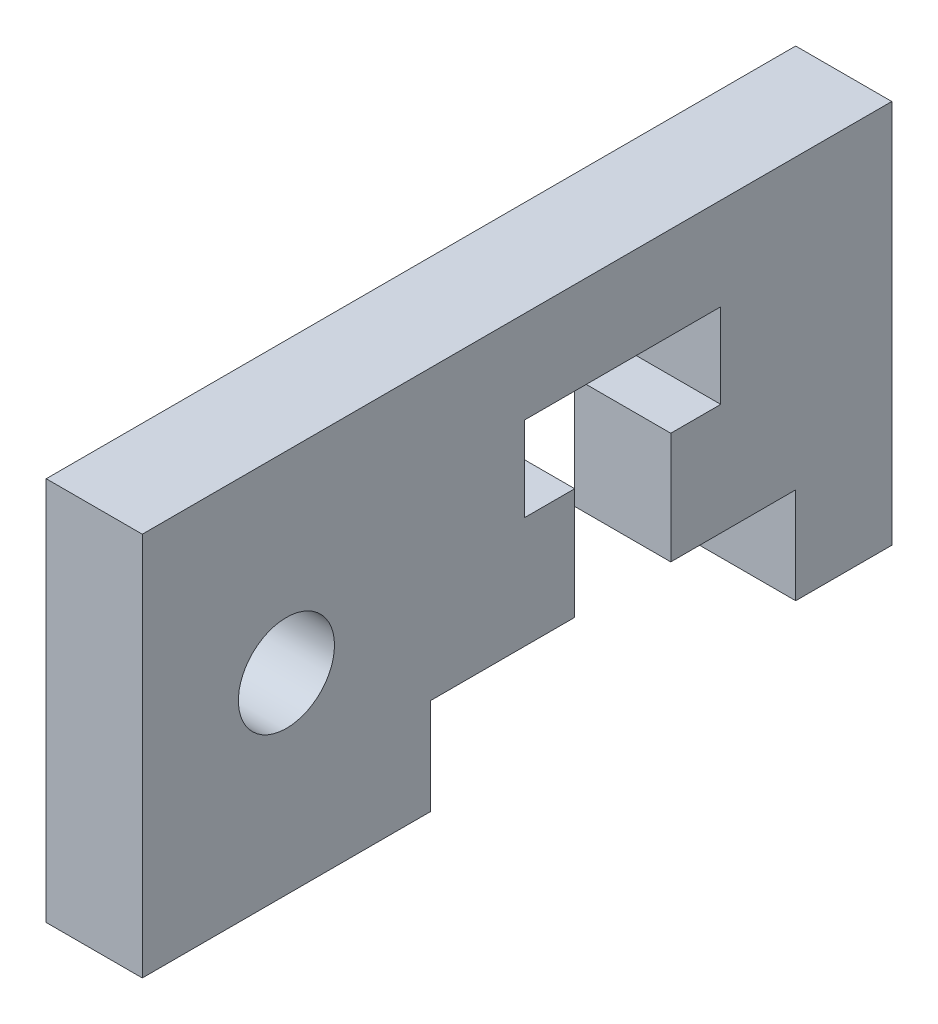
ISO-10303-21;
HEADER;
FILE_DESCRIPTION(('STEP AP214'),'2;1');
FILE_NAME('part.step','',(''),(''),'','','');
FILE_SCHEMA(('AUTOMOTIVE_DESIGN { 1 0 10303 214 1 1 1 1 }'));
ENDSEC;
DATA;
#1=APPLICATION_CONTEXT('core data for automotive mechanical design processes');
#2=APPLICATION_PROTOCOL_DEFINITION('international standard','automotive_design',2000,#1);
#3=PRODUCT_CONTEXT('',#1,'mechanical');
#4=PRODUCT('Part','Part','',(#3));
#5=PRODUCT_RELATED_PRODUCT_CATEGORY('part','',(#4));
#6=PRODUCT_DEFINITION_FORMATION('','',#4);
#7=PRODUCT_DEFINITION_CONTEXT('part definition',#1,'design');
#8=PRODUCT_DEFINITION('design','',#6,#7);
#9=PRODUCT_DEFINITION_SHAPE('','',#8);
#10=(LENGTH_UNIT() NAMED_UNIT(*) SI_UNIT(.MILLI.,.METRE.));
#11=(NAMED_UNIT(*) PLANE_ANGLE_UNIT() SI_UNIT($,.RADIAN.));
#12=(NAMED_UNIT(*) SI_UNIT($,.STERADIAN.) SOLID_ANGLE_UNIT());
#13=UNCERTAINTY_MEASURE_WITH_UNIT(LENGTH_MEASURE(1.E-05),#10,'distance_accuracy_value','');
#14=(GEOMETRIC_REPRESENTATION_CONTEXT(3) GLOBAL_UNCERTAINTY_ASSIGNED_CONTEXT((#13)) GLOBAL_UNIT_ASSIGNED_CONTEXT((#10,
#11,#12)) REPRESENTATION_CONTEXT('',''));
#15=CARTESIAN_POINT('',(0.,0.,0.));
#16=DIRECTION('',(0.,0.,1.));
#17=DIRECTION('',(1.,0.,0.));
#18=AXIS2_PLACEMENT_3D('',#15,#16,#17);
#19=CARTESIAN_POINT('',(-1.5875,6.35,-20.0025));
#20=DIRECTION('',(0.,1.,0.));
#21=DIRECTION('',(0.,0.,1.));
#22=AXIS2_PLACEMENT_3D('',#19,#20,#21);
#23=PLANE('',#22);
#24=DIRECTION('',(1.,0.,0.));
#25=VECTOR('',#24,1.);
#26=CARTESIAN_POINT('',(-1.5875,6.35,4.7625));
#27=LINE('',#26,#25);
#28=CARTESIAN_POINT('',(-1.5875,6.35,4.7625));
#29=VERTEX_POINT('',#28);
#30=CARTESIAN_POINT('',(1.5875,6.35,4.7625));
#31=VERTEX_POINT('',#30);
#32=EDGE_CURVE('E35',#29,#31,#27,.T.);
#33=ORIENTED_EDGE('',*,*,#32,.T.);
#34=DIRECTION('',(0.,0.,1.));
#35=VECTOR('',#34,1.);
#36=CARTESIAN_POINT('',(1.5875,6.35,-20.0025));
#37=LINE('',#36,#35);
#38=CARTESIAN_POINT('',(1.5875,6.35,-20.0025));
#39=VERTEX_POINT('',#38);
#40=EDGE_CURVE('E144',#39,#31,#37,.T.);
#41=ORIENTED_EDGE('',*,*,#40,.F.);
#42=DIRECTION('',(1.,0.,0.));
#43=VECTOR('',#42,1.);
#44=CARTESIAN_POINT('',(-1.5875,6.35,-20.0025));
#45=LINE('',#44,#43);
#46=CARTESIAN_POINT('',(-1.5875,6.35,-20.0025));
#47=VERTEX_POINT('',#46);
#48=EDGE_CURVE('E11',#47,#39,#45,.T.);
#49=ORIENTED_EDGE('',*,*,#48,.F.);
#50=DIRECTION('',(0.,0.,1.));
#51=VECTOR('',#50,1.);
#52=CARTESIAN_POINT('',(-1.5875,6.35,-20.0025));
#53=LINE('',#52,#51);
#54=EDGE_CURVE('E145',#47,#29,#53,.T.);
#55=ORIENTED_EDGE('',*,*,#54,.T.);
#56=EDGE_LOOP('',(#33,#41,#49,#55));
#57=FACE_BOUND('',#56,.T.);
#58=ADVANCED_FACE('F32',(#57),#23,.T.);
#59=CARTESIAN_POINT('',(-1.5875,-6.35,-20.0025));
#60=DIRECTION('',(0.,0.,-1.));
#61=DIRECTION('',(0.,1.,0.));
#62=AXIS2_PLACEMENT_3D('',#59,#60,#61);
#63=PLANE('',#62);
#64=ORIENTED_EDGE('',*,*,#48,.T.);
#65=DIRECTION('',(0.,1.,0.));
#66=VECTOR('',#65,1.);
#67=CARTESIAN_POINT('',(1.5875,-6.35,-20.0025));
#68=LINE('',#67,#66);
#69=CARTESIAN_POINT('',(1.5875,-6.35,-20.0025));
#70=VERTEX_POINT('',#69);
#71=EDGE_CURVE('E163',#70,#39,#68,.T.);
#72=ORIENTED_EDGE('',*,*,#71,.F.);
#73=DIRECTION('',(1.,0.,0.));
#74=VECTOR('',#73,1.);
#75=CARTESIAN_POINT('',(-1.5875,-6.35,-20.0025));
#76=LINE('',#75,#74);
#77=CARTESIAN_POINT('',(-1.5875,-6.35,-20.0025));
#78=VERTEX_POINT('',#77);
#79=EDGE_CURVE('E40',#78,#70,#76,.T.);
#80=ORIENTED_EDGE('',*,*,#79,.F.);
#81=DIRECTION('',(0.,1.,0.));
#82=VECTOR('',#81,1.);
#83=CARTESIAN_POINT('',(-1.5875,-6.35,-20.0025));
#84=LINE('',#83,#82);
#85=EDGE_CURVE('E150',#78,#47,#84,.T.);
#86=ORIENTED_EDGE('',*,*,#85,.T.);
#87=EDGE_LOOP('',(#64,#72,#80,#86));
#88=FACE_BOUND('',#87,.T.);
#89=ADVANCED_FACE('F329',(#88),#63,.T.);
#90=CARTESIAN_POINT('',(-1.5875,-6.35,-16.8275));
#91=DIRECTION('',(0.,-1.,0.));
#92=DIRECTION('',(0.,0.,-1.));
#93=AXIS2_PLACEMENT_3D('',#90,#91,#92);
#94=PLANE('',#93);
#95=ORIENTED_EDGE('',*,*,#79,.T.);
#96=DIRECTION('',(0.,0.,-1.));
#97=VECTOR('',#96,1.);
#98=CARTESIAN_POINT('',(1.5875,-6.35,-16.8275));
#99=LINE('',#98,#97);
#100=CARTESIAN_POINT('',(1.5875,-6.35,-16.8275));
#101=VERTEX_POINT('',#100);
#102=EDGE_CURVE('E203',#101,#70,#99,.T.);
#103=ORIENTED_EDGE('',*,*,#102,.F.);
#104=DIRECTION('',(1.,0.,0.));
#105=VECTOR('',#104,1.);
#106=CARTESIAN_POINT('',(-1.5875,-6.35,-16.8275));
#107=LINE('',#106,#105);
#108=CARTESIAN_POINT('',(-1.5875,-6.35,-16.8275));
#109=VERTEX_POINT('',#108);
#110=EDGE_CURVE('E252',#109,#101,#107,.T.);
#111=ORIENTED_EDGE('',*,*,#110,.F.);
#112=DIRECTION('',(0.,0.,-1.));
#113=VECTOR('',#112,1.);
#114=CARTESIAN_POINT('',(-1.5875,-6.35,-16.8275));
#115=LINE('',#114,#113);
#116=EDGE_CURVE('E248',#109,#78,#115,.T.);
#117=ORIENTED_EDGE('',*,*,#116,.T.);
#118=EDGE_LOOP('',(#95,#103,#111,#117));
#119=FACE_BOUND('',#118,.T.);
#120=ADVANCED_FACE('F327',(#119),#94,.T.);
#121=CARTESIAN_POINT('',(-1.5875,-3.175,-16.8275));
#122=DIRECTION('',(0.,0.,1.));
#123=DIRECTION('',(1.,0.,0.));
#124=AXIS2_PLACEMENT_3D('',#121,#122,#123);
#125=PLANE('',#124);
#126=ORIENTED_EDGE('',*,*,#110,.T.);
#127=DIRECTION('',(0.,-1.,0.));
#128=VECTOR('',#127,1.);
#129=CARTESIAN_POINT('',(1.5875,-3.175,-16.8275));
#130=LINE('',#129,#128);
#131=CARTESIAN_POINT('',(1.5875,-3.175,-16.8275));
#132=VERTEX_POINT('',#131);
#133=EDGE_CURVE('E200',#132,#101,#130,.T.);
#134=ORIENTED_EDGE('',*,*,#133,.F.);
#135=DIRECTION('',(1.,0.,0.));
#136=VECTOR('',#135,1.);
#137=CARTESIAN_POINT('',(-1.5875,-3.175,-16.8275));
#138=LINE('',#137,#136);
#139=CARTESIAN_POINT('',(-1.5875,-3.175,-16.8275));
#140=VERTEX_POINT('',#139);
#141=EDGE_CURVE('E254',#140,#132,#138,.T.);
#142=ORIENTED_EDGE('',*,*,#141,.F.);
#143=DIRECTION('',(0.,-1.,0.));
#144=VECTOR('',#143,1.);
#145=CARTESIAN_POINT('',(-1.5875,-3.175,-16.8275));
#146=LINE('',#145,#144);
#147=EDGE_CURVE('E245',#140,#109,#146,.T.);
#148=ORIENTED_EDGE('',*,*,#147,.T.);
#149=EDGE_LOOP('',(#126,#134,#142,#148));
#150=FACE_BOUND('',#149,.T.);
#151=ADVANCED_FACE('F323',(#150),#125,.T.);
#152=CARTESIAN_POINT('',(-1.5875,-3.175,-12.7));
#153=DIRECTION('',(0.,-1.,0.));
#154=DIRECTION('',(0.,0.,-1.));
#155=AXIS2_PLACEMENT_3D('',#152,#153,#154);
#156=PLANE('',#155);
#157=ORIENTED_EDGE('',*,*,#141,.T.);
#158=DIRECTION('',(0.,0.,-1.));
#159=VECTOR('',#158,1.);
#160=CARTESIAN_POINT('',(1.5875,-3.175,-12.7));
#161=LINE('',#160,#159);
#162=CARTESIAN_POINT('',(1.5875,-3.175,-12.7));
#163=VERTEX_POINT('',#162);
#164=EDGE_CURVE('E197',#163,#132,#161,.T.);
#165=ORIENTED_EDGE('',*,*,#164,.F.);
#166=DIRECTION('',(1.,0.,0.));
#167=VECTOR('',#166,1.);
#168=CARTESIAN_POINT('',(-1.5875,-3.175,-12.7));
#169=LINE('',#168,#167);
#170=CARTESIAN_POINT('',(-1.5875,-3.175,-12.7));
#171=VERTEX_POINT('',#170);
#172=EDGE_CURVE('E256',#171,#163,#169,.T.);
#173=ORIENTED_EDGE('',*,*,#172,.F.);
#174=DIRECTION('',(0.,0.,-1.));
#175=VECTOR('',#174,1.);
#176=CARTESIAN_POINT('',(-1.5875,-3.175,-12.7));
#177=LINE('',#176,#175);
#178=EDGE_CURVE('E242',#171,#140,#177,.T.);
#179=ORIENTED_EDGE('',*,*,#178,.T.);
#180=EDGE_LOOP('',(#157,#165,#173,#179));
#181=FACE_BOUND('',#180,.T.);
#182=ADVANCED_FACE('F321',(#181),#156,.T.);
#183=CARTESIAN_POINT('',(-1.5875,-3.175,-12.7));
#184=DIRECTION('',(0.,0.,1.));
#185=DIRECTION('',(1.,0.,0.));
#186=AXIS2_PLACEMENT_3D('',#183,#184,#185);
#187=PLANE('',#186);
#188=ORIENTED_EDGE('',*,*,#172,.T.);
#189=DIRECTION('',(0.,-1.,0.));
#190=VECTOR('',#189,1.);
#191=CARTESIAN_POINT('',(1.5875,-3.175,-12.7));
#192=LINE('',#191,#190);
#193=CARTESIAN_POINT('',(1.5875,0.507999999999998,-12.7));
#194=VERTEX_POINT('',#193);
#195=EDGE_CURVE('E194',#194,#163,#192,.T.);
#196=ORIENTED_EDGE('',*,*,#195,.F.);
#197=DIRECTION('',(1.,0.,0.));
#198=VECTOR('',#197,1.);
#199=CARTESIAN_POINT('',(-1.5875,0.507999999999998,-12.7));
#200=LINE('',#199,#198);
#201=CARTESIAN_POINT('',(-1.5875,0.507999999999998,-12.7));
#202=VERTEX_POINT('',#201);
#203=EDGE_CURVE('E258',#202,#194,#200,.T.);
#204=ORIENTED_EDGE('',*,*,#203,.F.);
#205=DIRECTION('',(0.,-1.,0.));
#206=VECTOR('',#205,1.);
#207=CARTESIAN_POINT('',(-1.5875,-3.175,-12.7));
#208=LINE('',#207,#206);
#209=EDGE_CURVE('E239',#202,#171,#208,.T.);
#210=ORIENTED_EDGE('',*,*,#209,.T.);
#211=EDGE_LOOP('',(#188,#196,#204,#210));
#212=FACE_BOUND('',#211,.T.);
#213=ADVANCED_FACE('F316',(#212),#187,.T.);
#214=CARTESIAN_POINT('',(-1.5875,0.507999999999998,-12.7));
#215=DIRECTION('',(0.,1.,0.));
#216=DIRECTION('',(0.,0.,1.));
#217=AXIS2_PLACEMENT_3D('',#214,#215,#216);
#218=PLANE('',#217);
#219=ORIENTED_EDGE('',*,*,#203,.T.);
#220=DIRECTION('',(0.,0.,1.));
#221=VECTOR('',#220,1.);
#222=CARTESIAN_POINT('',(1.5875,0.507999999999998,-12.7));
#223=LINE('',#222,#221);
#224=CARTESIAN_POINT('',(1.5875,0.507999999999998,-14.351));
#225=VERTEX_POINT('',#224);
#226=EDGE_CURVE('E191',#225,#194,#223,.T.);
#227=ORIENTED_EDGE('',*,*,#226,.F.);
#228=DIRECTION('',(1.,0.,0.));
#229=VECTOR('',#228,1.);
#230=CARTESIAN_POINT('',(-1.5875,0.507999999999998,-14.351));
#231=LINE('',#230,#229);
#232=CARTESIAN_POINT('',(-1.5875,0.507999999999998,-14.351));
#233=VERTEX_POINT('',#232);
#234=EDGE_CURVE('E260',#233,#225,#231,.T.);
#235=ORIENTED_EDGE('',*,*,#234,.F.);
#236=DIRECTION('',(0.,0.,1.));
#237=VECTOR('',#236,1.);
#238=CARTESIAN_POINT('',(-1.5875,0.507999999999998,-12.7));
#239=LINE('',#238,#237);
#240=EDGE_CURVE('E236',#233,#202,#239,.T.);
#241=ORIENTED_EDGE('',*,*,#240,.T.);
#242=EDGE_LOOP('',(#219,#227,#235,#241));
#243=FACE_BOUND('',#242,.T.);
#244=ADVANCED_FACE('F311',(#243),#218,.T.);
#245=CARTESIAN_POINT('',(-1.5875,0.507999999999998,-14.351));
#246=DIRECTION('',(0.,0.,1.));
#247=DIRECTION('',(1.,0.,0.));
#248=AXIS2_PLACEMENT_3D('',#245,#246,#247);
#249=PLANE('',#248);
#250=ORIENTED_EDGE('',*,*,#234,.T.);
#251=DIRECTION('',(0.,-1.,0.));
#252=VECTOR('',#251,1.);
#253=CARTESIAN_POINT('',(1.5875,0.507999999999998,-14.351));
#254=LINE('',#253,#252);
#255=CARTESIAN_POINT('',(1.5875,3.302,-14.351));
#256=VERTEX_POINT('',#255);
#257=EDGE_CURVE('E188',#256,#225,#254,.T.);
#258=ORIENTED_EDGE('',*,*,#257,.F.);
#259=DIRECTION('',(1.,0.,0.));
#260=VECTOR('',#259,1.);
#261=CARTESIAN_POINT('',(-1.5875,3.302,-14.351));
#262=LINE('',#261,#260);
#263=CARTESIAN_POINT('',(-1.5875,3.302,-14.351));
#264=VERTEX_POINT('',#263);
#265=EDGE_CURVE('E262',#264,#256,#262,.T.);
#266=ORIENTED_EDGE('',*,*,#265,.F.);
#267=DIRECTION('',(0.,-1.,0.));
#268=VECTOR('',#267,1.);
#269=CARTESIAN_POINT('',(-1.5875,0.507999999999998,-14.351));
#270=LINE('',#269,#268);
#271=EDGE_CURVE('E233',#264,#233,#270,.T.);
#272=ORIENTED_EDGE('',*,*,#271,.T.);
#273=EDGE_LOOP('',(#250,#258,#266,#272));
#274=FACE_BOUND('',#273,.T.);
#275=ADVANCED_FACE('F309',(#274),#249,.T.);
#276=CARTESIAN_POINT('',(-1.5875,3.302,-14.351));
#277=DIRECTION('',(0.,-1.,0.));
#278=DIRECTION('',(0.,0.,-1.));
#279=AXIS2_PLACEMENT_3D('',#276,#277,#278);
#280=PLANE('',#279);
#281=ORIENTED_EDGE('',*,*,#265,.T.);
#282=DIRECTION('',(0.,0.,-1.));
#283=VECTOR('',#282,1.);
#284=CARTESIAN_POINT('',(1.5875,3.302,-14.351));
#285=LINE('',#284,#283);
#286=CARTESIAN_POINT('',(1.5875,3.302,-7.874));
#287=VERTEX_POINT('',#286);
#288=EDGE_CURVE('E185',#287,#256,#285,.T.);
#289=ORIENTED_EDGE('',*,*,#288,.F.);
#290=DIRECTION('',(1.,0.,0.));
#291=VECTOR('',#290,1.);
#292=CARTESIAN_POINT('',(-1.5875,3.302,-7.874));
#293=LINE('',#292,#291);
#294=CARTESIAN_POINT('',(-1.5875,3.302,-7.874));
#295=VERTEX_POINT('',#294);
#296=EDGE_CURVE('E264',#295,#287,#293,.T.);
#297=ORIENTED_EDGE('',*,*,#296,.F.);
#298=DIRECTION('',(0.,0.,-1.));
#299=VECTOR('',#298,1.);
#300=CARTESIAN_POINT('',(-1.5875,3.302,-14.351));
#301=LINE('',#300,#299);
#302=EDGE_CURVE('E230',#295,#264,#301,.T.);
#303=ORIENTED_EDGE('',*,*,#302,.T.);
#304=EDGE_LOOP('',(#281,#289,#297,#303));
#305=FACE_BOUND('',#304,.T.);
#306=ADVANCED_FACE('F304',(#305),#280,.T.);
#307=CARTESIAN_POINT('',(-1.5875,3.302,-7.874));
#308=DIRECTION('',(0.,0.,-1.));
#309=DIRECTION('',(-1.,0.,0.));
#310=AXIS2_PLACEMENT_3D('',#307,#308,#309);
#311=PLANE('',#310);
#312=ORIENTED_EDGE('',*,*,#296,.T.);
#313=DIRECTION('',(0.,1.,0.));
#314=VECTOR('',#313,1.);
#315=CARTESIAN_POINT('',(1.5875,3.302,-7.874));
#316=LINE('',#315,#314);
#317=CARTESIAN_POINT('',(1.5875,0.507999999999998,-7.874));
#318=VERTEX_POINT('',#317);
#319=EDGE_CURVE('E182',#318,#287,#316,.T.);
#320=ORIENTED_EDGE('',*,*,#319,.F.);
#321=DIRECTION('',(1.,0.,0.));
#322=VECTOR('',#321,1.);
#323=CARTESIAN_POINT('',(-1.5875,0.507999999999998,-7.874));
#324=LINE('',#323,#322);
#325=CARTESIAN_POINT('',(-1.5875,0.507999999999998,-7.874));
#326=VERTEX_POINT('',#325);
#327=EDGE_CURVE('E266',#326,#318,#324,.T.);
#328=ORIENTED_EDGE('',*,*,#327,.F.);
#329=DIRECTION('',(0.,1.,0.));
#330=VECTOR('',#329,1.);
#331=CARTESIAN_POINT('',(-1.5875,3.302,-7.874));
#332=LINE('',#331,#330);
#333=EDGE_CURVE('E227',#326,#295,#332,.T.);
#334=ORIENTED_EDGE('',*,*,#333,.T.);
#335=EDGE_LOOP('',(#312,#320,#328,#334));
#336=FACE_BOUND('',#335,.T.);
#337=ADVANCED_FACE('F299',(#336),#311,.T.);
#338=CARTESIAN_POINT('',(-1.5875,0.507999999999998,-7.874));
#339=DIRECTION('',(0.,1.,0.));
#340=DIRECTION('',(0.,0.,1.));
#341=AXIS2_PLACEMENT_3D('',#338,#339,#340);
#342=PLANE('',#341);
#343=ORIENTED_EDGE('',*,*,#327,.T.);
#344=DIRECTION('',(0.,0.,1.));
#345=VECTOR('',#344,1.);
#346=CARTESIAN_POINT('',(1.5875,0.507999999999998,-7.874));
#347=LINE('',#346,#345);
#348=CARTESIAN_POINT('',(1.5875,0.507999999999998,-9.525));
#349=VERTEX_POINT('',#348);
#350=EDGE_CURVE('E179',#349,#318,#347,.T.);
#351=ORIENTED_EDGE('',*,*,#350,.F.);
#352=DIRECTION('',(1.,0.,0.));
#353=VECTOR('',#352,1.);
#354=CARTESIAN_POINT('',(-1.5875,0.507999999999998,-9.525));
#355=LINE('',#354,#353);
#356=CARTESIAN_POINT('',(-1.5875,0.507999999999998,-9.525));
#357=VERTEX_POINT('',#356);
#358=EDGE_CURVE('E268',#357,#349,#355,.T.);
#359=ORIENTED_EDGE('',*,*,#358,.F.);
#360=DIRECTION('',(0.,0.,1.));
#361=VECTOR('',#360,1.);
#362=CARTESIAN_POINT('',(-1.5875,0.507999999999998,-7.874));
#363=LINE('',#362,#361);
#364=EDGE_CURVE('E224',#357,#326,#363,.T.);
#365=ORIENTED_EDGE('',*,*,#364,.T.);
#366=EDGE_LOOP('',(#343,#351,#359,#365));
#367=FACE_BOUND('',#366,.T.);
#368=ADVANCED_FACE('F297',(#367),#342,.T.);
#369=CARTESIAN_POINT('',(-1.5875,0.507999999999998,-9.525));
#370=DIRECTION('',(0.,0.,-1.));
#371=DIRECTION('',(0.,1.,0.));
#372=AXIS2_PLACEMENT_3D('',#369,#370,#371);
#373=PLANE('',#372);
#374=ORIENTED_EDGE('',*,*,#358,.T.);
#375=DIRECTION('',(0.,1.,0.));
#376=VECTOR('',#375,1.);
#377=CARTESIAN_POINT('',(1.5875,0.507999999999998,-9.525));
#378=LINE('',#377,#376);
#379=CARTESIAN_POINT('',(1.5875,-3.175,-9.525));
#380=VERTEX_POINT('',#379);
#381=EDGE_CURVE('E176',#380,#349,#378,.T.);
#382=ORIENTED_EDGE('',*,*,#381,.F.);
#383=DIRECTION('',(1.,0.,0.));
#384=VECTOR('',#383,1.);
#385=CARTESIAN_POINT('',(-1.5875,-3.175,-9.525));
#386=LINE('',#385,#384);
#387=CARTESIAN_POINT('',(-1.5875,-3.175,-9.525));
#388=VERTEX_POINT('',#387);
#389=EDGE_CURVE('E270',#388,#380,#386,.T.);
#390=ORIENTED_EDGE('',*,*,#389,.F.);
#391=DIRECTION('',(0.,1.,0.));
#392=VECTOR('',#391,1.);
#393=CARTESIAN_POINT('',(-1.5875,0.507999999999998,-9.525));
#394=LINE('',#393,#392);
#395=EDGE_CURVE('E221',#388,#357,#394,.T.);
#396=ORIENTED_EDGE('',*,*,#395,.T.);
#397=EDGE_LOOP('',(#374,#382,#390,#396));
#398=FACE_BOUND('',#397,.T.);
#399=ADVANCED_FACE('F292',(#398),#373,.T.);
#400=CARTESIAN_POINT('',(-1.5875,-3.175,-9.525));
#401=DIRECTION('',(0.,-1.,0.));
#402=DIRECTION('',(0.,0.,-1.));
#403=AXIS2_PLACEMENT_3D('',#400,#401,#402);
#404=PLANE('',#403);
#405=ORIENTED_EDGE('',*,*,#389,.T.);
#406=DIRECTION('',(0.,0.,-1.));
#407=VECTOR('',#406,1.);
#408=CARTESIAN_POINT('',(1.5875,-3.175,-9.525));
#409=LINE('',#408,#407);
#410=CARTESIAN_POINT('',(1.5875,-3.175,-4.7625));
#411=VERTEX_POINT('',#410);
#412=EDGE_CURVE('E173',#411,#380,#409,.T.);
#413=ORIENTED_EDGE('',*,*,#412,.F.);
#414=DIRECTION('',(1.,0.,0.));
#415=VECTOR('',#414,1.);
#416=CARTESIAN_POINT('',(-1.5875,-3.175,-4.7625));
#417=LINE('',#416,#415);
#418=CARTESIAN_POINT('',(-1.5875,-3.175,-4.7625));
#419=VERTEX_POINT('',#418);
#420=EDGE_CURVE('E272',#419,#411,#417,.T.);
#421=ORIENTED_EDGE('',*,*,#420,.F.);
#422=DIRECTION('',(0.,0.,-1.));
#423=VECTOR('',#422,1.);
#424=CARTESIAN_POINT('',(-1.5875,-3.175,-9.525));
#425=LINE('',#424,#423);
#426=EDGE_CURVE('E218',#419,#388,#425,.T.);
#427=ORIENTED_EDGE('',*,*,#426,.T.);
#428=EDGE_LOOP('',(#405,#413,#421,#427));
#429=FACE_BOUND('',#428,.T.);
#430=ADVANCED_FACE('F285',(#429),#404,.T.);
#431=CARTESIAN_POINT('',(-1.5875,-6.35,-4.7625));
#432=DIRECTION('',(0.,0.,-1.));
#433=DIRECTION('',(-1.,0.,0.));
#434=AXIS2_PLACEMENT_3D('',#431,#432,#433);
#435=PLANE('',#434);
#436=ORIENTED_EDGE('',*,*,#420,.T.);
#437=DIRECTION('',(0.,1.,0.));
#438=VECTOR('',#437,1.);
#439=CARTESIAN_POINT('',(1.5875,-6.35,-4.7625));
#440=LINE('',#439,#438);
#441=CARTESIAN_POINT('',(1.5875,-6.35,-4.7625));
#442=VERTEX_POINT('',#441);
#443=EDGE_CURVE('E170',#442,#411,#440,.T.);
#444=ORIENTED_EDGE('',*,*,#443,.F.);
#445=DIRECTION('',(1.,0.,0.));
#446=VECTOR('',#445,1.);
#447=CARTESIAN_POINT('',(-1.5875,-6.35,-4.7625));
#448=LINE('',#447,#446);
#449=CARTESIAN_POINT('',(-1.5875,-6.35,-4.7625));
#450=VERTEX_POINT('',#449);
#451=EDGE_CURVE('E274',#450,#442,#448,.T.);
#452=ORIENTED_EDGE('',*,*,#451,.F.);
#453=DIRECTION('',(0.,1.,0.));
#454=VECTOR('',#453,1.);
#455=CARTESIAN_POINT('',(-1.5875,-6.35,-4.7625));
#456=LINE('',#455,#454);
#457=EDGE_CURVE('E215',#450,#419,#456,.T.);
#458=ORIENTED_EDGE('',*,*,#457,.T.);
#459=EDGE_LOOP('',(#436,#444,#452,#458));
#460=FACE_BOUND('',#459,.T.);
#461=ADVANCED_FACE('F282',(#460),#435,.T.);
#462=CARTESIAN_POINT('',(-1.5875,-6.35,4.7625));
#463=DIRECTION('',(0.,-1.,0.));
#464=DIRECTION('',(0.,0.,-1.));
#465=AXIS2_PLACEMENT_3D('',#462,#463,#464);
#466=PLANE('',#465);
#467=ORIENTED_EDGE('',*,*,#451,.T.);
#468=DIRECTION('',(0.,0.,-1.));
#469=VECTOR('',#468,1.);
#470=CARTESIAN_POINT('',(1.5875,-6.35,4.7625));
#471=LINE('',#470,#469);
#472=CARTESIAN_POINT('',(1.5875,-6.35,4.7625));
#473=VERTEX_POINT('',#472);
#474=EDGE_CURVE('E157',#473,#442,#471,.T.);
#475=ORIENTED_EDGE('',*,*,#474,.F.);
#476=DIRECTION('',(1.,0.,0.));
#477=VECTOR('',#476,1.);
#478=CARTESIAN_POINT('',(-1.5875,-6.35,4.7625));
#479=LINE('',#478,#477);
#480=CARTESIAN_POINT('',(-1.5875,-6.35,4.7625));
#481=VERTEX_POINT('',#480);
#482=EDGE_CURVE('E149',#481,#473,#479,.T.);
#483=ORIENTED_EDGE('',*,*,#482,.F.);
#484=DIRECTION('',(0.,0.,-1.));
#485=VECTOR('',#484,1.);
#486=CARTESIAN_POINT('',(-1.5875,-6.35,4.7625));
#487=LINE('',#486,#485);
#488=EDGE_CURVE('E212',#481,#450,#487,.T.);
#489=ORIENTED_EDGE('',*,*,#488,.T.);
#490=EDGE_LOOP('',(#467,#475,#483,#489));
#491=FACE_BOUND('',#490,.T.);
#492=ADVANCED_FACE('F276',(#491),#466,.T.);
#493=CARTESIAN_POINT('',(-1.5875,6.35,4.7625));
#494=DIRECTION('',(0.,0.,1.));
#495=DIRECTION('',(0.,-1.,0.));
#496=AXIS2_PLACEMENT_3D('',#493,#494,#495);
#497=PLANE('',#496);
#498=ORIENTED_EDGE('',*,*,#482,.T.);
#499=DIRECTION('',(0.,-1.,0.));
#500=VECTOR('',#499,1.);
#501=CARTESIAN_POINT('',(1.5875,6.35,4.7625));
#502=LINE('',#501,#500);
#503=EDGE_CURVE('E152',#31,#473,#502,.T.);
#504=ORIENTED_EDGE('',*,*,#503,.F.);
#505=ORIENTED_EDGE('',*,*,#32,.F.);
#506=DIRECTION('',(0.,-1.,0.));
#507=VECTOR('',#506,1.);
#508=CARTESIAN_POINT('',(-1.5875,6.35,4.7625));
#509=LINE('',#508,#507);
#510=EDGE_CURVE('E210',#29,#481,#509,.T.);
#511=ORIENTED_EDGE('',*,*,#510,.T.);
#512=EDGE_LOOP('',(#498,#504,#505,#511));
#513=FACE_BOUND('',#512,.T.);
#514=ADVANCED_FACE('F153',(#513),#497,.T.);
#515=CARTESIAN_POINT('',(-1.5875,6.35,4.7625));
#516=DIRECTION('',(1.,0.,0.));
#517=DIRECTION('',(0.,0.,-1.));
#518=AXIS2_PLACEMENT_3D('',#515,#516,#517);
#519=PLANE('',#518);
#520=CARTESIAN_POINT('',(-1.5875,0.,0.));
#521=DIRECTION('',(1.,0.,0.));
#522=DIRECTION('',(0.,0.,-1.));
#523=AXIS2_PLACEMENT_3D('',#520,#521,#522);
#524=CIRCLE('',#523,1.5875);
#525=CARTESIAN_POINT('',(-1.5875,0.,-1.5875));
#526=VERTEX_POINT('',#525);
#527=EDGE_CURVE('E206',#526,#526,#524,.T.);
#528=ORIENTED_EDGE('',*,*,#527,.T.);
#529=EDGE_LOOP('',(#528));
#530=FACE_BOUND('',#529,.T.);
#531=ORIENTED_EDGE('',*,*,#54,.F.);
#532=ORIENTED_EDGE('',*,*,#85,.F.);
#533=ORIENTED_EDGE('',*,*,#116,.F.);
#534=ORIENTED_EDGE('',*,*,#147,.F.);
#535=ORIENTED_EDGE('',*,*,#178,.F.);
#536=ORIENTED_EDGE('',*,*,#209,.F.);
#537=ORIENTED_EDGE('',*,*,#240,.F.);
#538=ORIENTED_EDGE('',*,*,#271,.F.);
#539=ORIENTED_EDGE('',*,*,#302,.F.);
#540=ORIENTED_EDGE('',*,*,#333,.F.);
#541=ORIENTED_EDGE('',*,*,#364,.F.);
#542=ORIENTED_EDGE('',*,*,#395,.F.);
#543=ORIENTED_EDGE('',*,*,#426,.F.);
#544=ORIENTED_EDGE('',*,*,#457,.F.);
#545=ORIENTED_EDGE('',*,*,#488,.F.);
#546=ORIENTED_EDGE('',*,*,#510,.F.);
#547=EDGE_LOOP('',(#531,#532,#533,#534,#535,#536,#537,#538,#539,#540,#541,#542,#543,#544,#545,#546));
#548=FACE_BOUND('',#547,.T.);
#549=ADVANCED_FACE('F288',(#530,#548),#519,.F.);
#550=CARTESIAN_POINT('',(-1.5875,0.,0.));
#551=DIRECTION('',(1.,0.,0.));
#552=DIRECTION('',(0.,0.,-1.));
#553=AXIS2_PLACEMENT_3D('',#550,#551,#552);
#554=CYLINDRICAL_SURFACE('',#553,1.5875);
#555=ORIENTED_EDGE('',*,*,#527,.F.);
#556=EDGE_LOOP('',(#555));
#557=FACE_BOUND('',#556,.T.);
#558=CARTESIAN_POINT('',(1.5875,0.,0.));
#559=DIRECTION('',(1.,0.,0.));
#560=DIRECTION('',(0.,0.,-1.));
#561=AXIS2_PLACEMENT_3D('',#558,#559,#560);
#562=CIRCLE('',#561,1.5875);
#563=CARTESIAN_POINT('',(1.5875,0.,-1.5875));
#564=VERTEX_POINT('',#563);
#565=EDGE_CURVE('E164',#564,#564,#562,.T.);
#566=ORIENTED_EDGE('',*,*,#565,.T.);
#567=EDGE_LOOP('',(#566));
#568=FACE_BOUND('',#567,.T.);
#569=ADVANCED_FACE('F367',(#557,#568),#554,.F.);
#570=CARTESIAN_POINT('',(1.5875,6.35,4.7625));
#571=DIRECTION('',(1.,0.,0.));
#572=DIRECTION('',(0.,0.,-1.));
#573=AXIS2_PLACEMENT_3D('',#570,#571,#572);
#574=PLANE('',#573);
#575=ORIENTED_EDGE('',*,*,#40,.T.);
#576=ORIENTED_EDGE('',*,*,#503,.T.);
#577=ORIENTED_EDGE('',*,*,#474,.T.);
#578=ORIENTED_EDGE('',*,*,#443,.T.);
#579=ORIENTED_EDGE('',*,*,#412,.T.);
#580=ORIENTED_EDGE('',*,*,#381,.T.);
#581=ORIENTED_EDGE('',*,*,#350,.T.);
#582=ORIENTED_EDGE('',*,*,#319,.T.);
#583=ORIENTED_EDGE('',*,*,#288,.T.);
#584=ORIENTED_EDGE('',*,*,#257,.T.);
#585=ORIENTED_EDGE('',*,*,#226,.T.);
#586=ORIENTED_EDGE('',*,*,#195,.T.);
#587=ORIENTED_EDGE('',*,*,#164,.T.);
#588=ORIENTED_EDGE('',*,*,#133,.T.);
#589=ORIENTED_EDGE('',*,*,#102,.T.);
#590=ORIENTED_EDGE('',*,*,#71,.T.);
#591=EDGE_LOOP('',(#575,#576,#577,#578,#579,#580,#581,#582,#583,#584,#585,#586,#587,#588,#589,#590));
#592=FACE_BOUND('',#591,.T.);
#593=ORIENTED_EDGE('',*,*,#565,.F.);
#594=EDGE_LOOP('',(#593));
#595=FACE_BOUND('',#594,.T.);
#596=ADVANCED_FACE('F160',(#592,#595),#574,.T.);
#597=CLOSED_SHELL('',(#58,#89,#120,#151,#182,#213,#244,#275,#306,#337,#368,#399,#430,#461,#492,
#514,#549,#569,#596));
#598=MANIFOLD_SOLID_BREP('B2',#597);
#599=ADVANCED_BREP_SHAPE_REPRESENTATION('',(#18,#598),#14);
#600=SHAPE_DEFINITION_REPRESENTATION(#9,#599);
ENDSEC;
END-ISO-10303-21;
